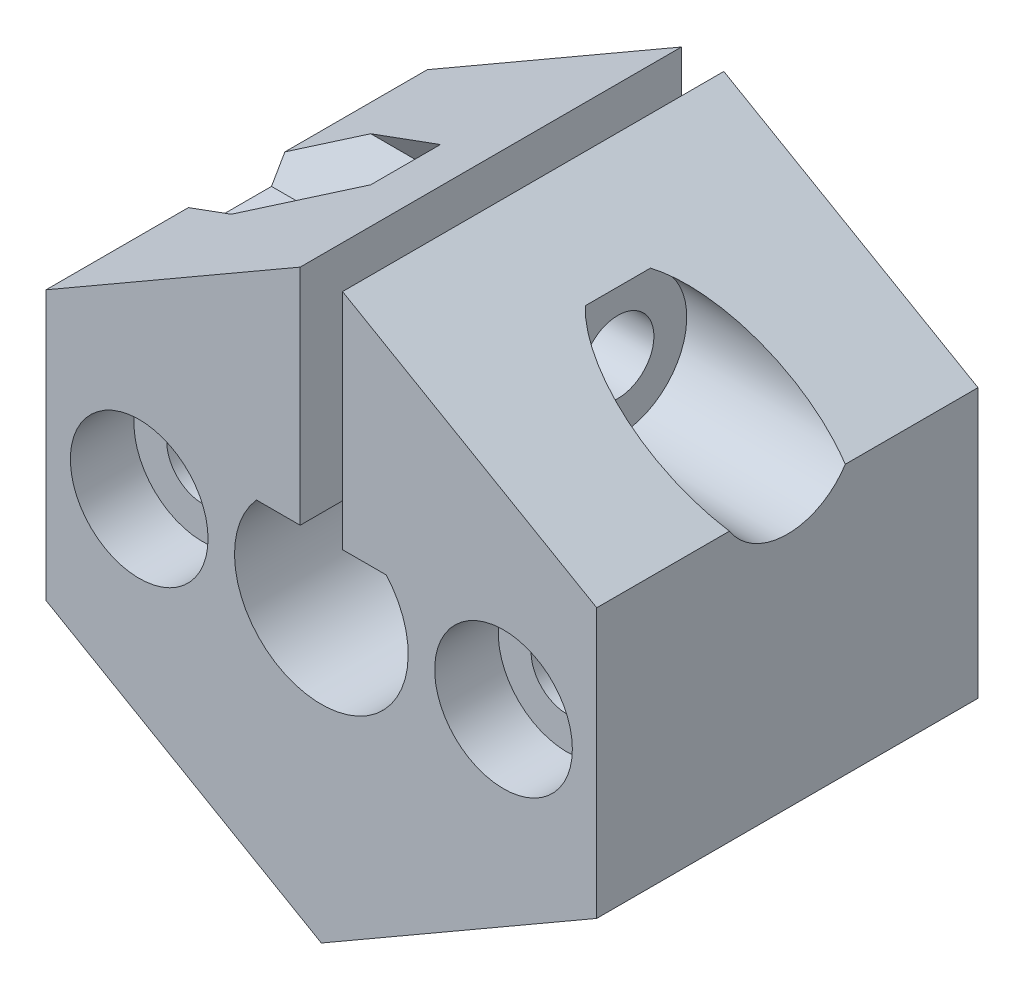
ISO-10303-21;
HEADER;
FILE_DESCRIPTION(('STEP AP214'),'2;1');
FILE_NAME('part.step','',(''),(''),'','','');
FILE_SCHEMA(('AUTOMOTIVE_DESIGN { 1 0 10303 214 1 1 1 1 }'));
ENDSEC;
DATA;
#1=APPLICATION_CONTEXT('core data for automotive mechanical design processes');
#2=APPLICATION_PROTOCOL_DEFINITION('international standard','automotive_design',2000,#1);
#3=PRODUCT_CONTEXT('',#1,'mechanical');
#4=PRODUCT('Part','Part','',(#3));
#5=PRODUCT_RELATED_PRODUCT_CATEGORY('part','',(#4));
#6=PRODUCT_DEFINITION_FORMATION('','',#4);
#7=PRODUCT_DEFINITION_CONTEXT('part definition',#1,'design');
#8=PRODUCT_DEFINITION('design','',#6,#7);
#9=PRODUCT_DEFINITION_SHAPE('','',#8);
#10=(LENGTH_UNIT() NAMED_UNIT(*) SI_UNIT(.MILLI.,.METRE.));
#11=(NAMED_UNIT(*) PLANE_ANGLE_UNIT() SI_UNIT($,.RADIAN.));
#12=(NAMED_UNIT(*) SI_UNIT($,.STERADIAN.) SOLID_ANGLE_UNIT());
#13=UNCERTAINTY_MEASURE_WITH_UNIT(LENGTH_MEASURE(1.E-05),#10,'distance_accuracy_value','');
#14=(GEOMETRIC_REPRESENTATION_CONTEXT(3) GLOBAL_UNCERTAINTY_ASSIGNED_CONTEXT((#13)) GLOBAL_UNIT_ASSIGNED_CONTEXT((#10,
#11,#12)) REPRESENTATION_CONTEXT('',''));
#15=CARTESIAN_POINT('',(0.,0.,0.));
#16=DIRECTION('',(0.,0.,1.));
#17=DIRECTION('',(1.,0.,0.));
#18=AXIS2_PLACEMENT_3D('',#15,#16,#17);
#19=CARTESIAN_POINT('',(-6.,10.3923048454133,18.));
#20=DIRECTION('',(0.5,-0.866025403784439,0.));
#21=DIRECTION('',(0.866025403784439,0.5,0.));
#22=AXIS2_PLACEMENT_3D('',#19,#20,#21);
#23=PLANE('',#22);
#24=DIRECTION('',(-0.832050294337844,-0.480384461415261,0.277350098112615));
#25=VECTOR('',#24,1.);
#26=CARTESIAN_POINT('',(-9.14092167282028,8.57889287210694,5.43631330871886));
#27=LINE('',#26,#25);
#28=CARTESIAN_POINT('',(-9.95929214352109,8.10640646055099,5.70910346561913));
#29=VERTEX_POINT('',#28);
#30=CARTESIAN_POINT('',(-13.,6.35085296108588,6.7226727511121));
#31=VERTEX_POINT('',#30);
#32=EDGE_CURVE('E223',#29,#31,#27,.T.);
#33=ORIENTED_EDGE('',*,*,#32,.F.);
#34=DIRECTION('',(-0.832050294337844,-0.480384461415261,-0.277350098112615));
#35=VECTOR('',#34,1.);
#36=CARTESIAN_POINT('',(-3.46820019541373,11.8540401441254,7.87280078165492));
#37=LINE('',#36,#35);
#38=CARTESIAN_POINT('',(-5.02294734194979,10.956406460551,7.35455173280957));
#39=VERTEX_POINT('',#38);
#40=EDGE_CURVE('E11',#39,#29,#37,.T.);
#41=ORIENTED_EDGE('',*,*,#40,.F.);
#42=DIRECTION('',(0.,0.,-1.));
#43=VECTOR('',#42,1.);
#44=CARTESIAN_POINT('',(-5.02294734194979,10.956406460551,18.));
#45=LINE('',#44,#43);
#46=CARTESIAN_POINT('',(-5.02294734194979,10.956406460551,10.6454482671904));
#47=VERTEX_POINT('',#46);
#48=EDGE_CURVE('E58',#47,#39,#45,.T.);
#49=ORIENTED_EDGE('',*,*,#48,.F.);
#50=DIRECTION('',(0.832050294337844,0.480384461415261,-0.277350098112614));
#51=VECTOR('',#50,1.);
#52=CARTESIAN_POINT('',(-7.62204634925988,9.45581594903002,11.5118146029605));
#53=LINE('',#52,#51);
#54=CARTESIAN_POINT('',(-9.95929214352109,8.10640646055099,12.2908965343809));
#55=VERTEX_POINT('',#54);
#56=EDGE_CURVE('E411',#55,#47,#53,.T.);
#57=ORIENTED_EDGE('',*,*,#56,.F.);
#58=DIRECTION('',(0.832050294337844,0.480384461415261,0.277350098112614));
#59=VECTOR('',#58,1.);
#60=CARTESIAN_POINT('',(-4.98707551897413,10.9771170672023,13.9483020758965));
#61=LINE('',#60,#59);
#62=CARTESIAN_POINT('',(-13.,6.35085296108588,11.2773272488879));
#63=VERTEX_POINT('',#62);
#64=EDGE_CURVE('E215',#63,#55,#61,.T.);
#65=ORIENTED_EDGE('',*,*,#64,.F.);
#66=DIRECTION('',(0.,0.,-1.));
#67=VECTOR('',#66,1.);
#68=CARTESIAN_POINT('',(-13.,6.35085296108588,18.));
#69=LINE('',#68,#67);
#70=CARTESIAN_POINT('',(-13.,6.35085296108588,18.));
#71=VERTEX_POINT('',#70);
#72=EDGE_CURVE('E378',#71,#63,#69,.T.);
#73=ORIENTED_EDGE('',*,*,#72,.F.);
#74=DIRECTION('',(-0.866025403784439,-0.5,0.));
#75=VECTOR('',#74,1.);
#76=CARTESIAN_POINT('',(-6.,10.3923048454133,18.));
#77=LINE('',#76,#75);
#78=CARTESIAN_POINT('',(-0.999999999999999,13.2790561913614,18.));
#79=VERTEX_POINT('',#78);
#80=EDGE_CURVE('E286',#79,#71,#77,.T.);
#81=ORIENTED_EDGE('',*,*,#80,.F.);
#82=DIRECTION('',(0.,0.,-1.));
#83=VECTOR('',#82,1.);
#84=CARTESIAN_POINT('',(-0.999999999999999,13.2790561913614,18.));
#85=LINE('',#84,#83);
#86=CARTESIAN_POINT('',(-0.999999999999999,13.2790561913614,0.));
#87=VERTEX_POINT('',#86);
#88=EDGE_CURVE('E382',#79,#87,#85,.T.);
#89=ORIENTED_EDGE('',*,*,#88,.T.);
#90=DIRECTION('',(-0.866025403784439,-0.5,0.));
#91=VECTOR('',#90,1.);
#92=CARTESIAN_POINT('',(-6.,10.3923048454133,0.));
#93=LINE('',#92,#91);
#94=CARTESIAN_POINT('',(-13.,6.35085296108588,0.));
#95=VERTEX_POINT('',#94);
#96=EDGE_CURVE('E324',#87,#95,#93,.T.);
#97=ORIENTED_EDGE('',*,*,#96,.T.);
#98=EDGE_CURVE('E377',#31,#95,#69,.T.);
#99=ORIENTED_EDGE('',*,*,#98,.F.);
#100=EDGE_LOOP('',(#33,#41,#49,#57,#65,#73,#81,#89,#97,#99));
#101=FACE_BOUND('',#100,.T.);
#102=ADVANCED_FACE('F49',(#101),#23,.F.);
#103=CARTESIAN_POINT('',(-13.,0.,18.));
#104=DIRECTION('',(1.,0.,0.));
#105=DIRECTION('',(0.,0.,-1.));
#106=AXIS2_PLACEMENT_3D('',#103,#104,#105);
#107=PLANE('',#106);
#108=DIRECTION('',(0.,-0.866025403784438,0.5));
#109=VECTOR('',#108,1.);
#110=CARTESIAN_POINT('',(-13.,-3.29551270189223,12.2920045633341));
#111=LINE('',#110,#109);
#112=CARTESIAN_POINT('',(-13.,5.25640646055099,7.35455173280957));
#113=VERTEX_POINT('',#112);
#114=EDGE_CURVE('E408',#31,#113,#111,.T.);
#115=ORIENTED_EDGE('',*,*,#114,.F.);
#116=ORIENTED_EDGE('',*,*,#98,.T.);
#117=DIRECTION('',(0.,-1.,0.));
#118=VECTOR('',#117,1.);
#119=CARTESIAN_POINT('',(-13.,0.,0.));
#120=LINE('',#119,#118);
#121=CARTESIAN_POINT('',(-13.,-6.35085296108589,0.));
#122=VERTEX_POINT('',#121);
#123=EDGE_CURVE('E328',#95,#122,#120,.T.);
#124=ORIENTED_EDGE('',*,*,#123,.T.);
#125=DIRECTION('',(0.,0.,-1.));
#126=VECTOR('',#125,1.);
#127=CARTESIAN_POINT('',(-13.,-6.35085296108589,18.));
#128=LINE('',#127,#126);
#129=CARTESIAN_POINT('',(-13.,-6.35085296108589,18.));
#130=VERTEX_POINT('',#129);
#131=EDGE_CURVE('E373',#130,#122,#128,.T.);
#132=ORIENTED_EDGE('',*,*,#131,.F.);
#133=DIRECTION('',(0.,-1.,0.));
#134=VECTOR('',#133,1.);
#135=CARTESIAN_POINT('',(-13.,0.,18.));
#136=LINE('',#135,#134);
#137=EDGE_CURVE('E289',#71,#130,#136,.T.);
#138=ORIENTED_EDGE('',*,*,#137,.F.);
#139=ORIENTED_EDGE('',*,*,#72,.T.);
#140=DIRECTION('',(0.,0.866025403784439,0.5));
#141=VECTOR('',#140,1.);
#142=CARTESIAN_POINT('',(-13.,4.49871593216772,10.2079954366659));
#143=LINE('',#142,#141);
#144=CARTESIAN_POINT('',(-13.,5.25640646055099,10.6454482671904));
#145=VERTEX_POINT('',#144);
#146=EDGE_CURVE('E405',#145,#63,#143,.T.);
#147=ORIENTED_EDGE('',*,*,#146,.F.);
#148=DIRECTION('',(0.,0.,1.));
#149=VECTOR('',#148,1.);
#150=CARTESIAN_POINT('',(-13.,5.25640646055099,18.));
#151=LINE('',#150,#149);
#152=EDGE_CURVE('E402',#113,#145,#151,.T.);
#153=ORIENTED_EDGE('',*,*,#152,.F.);
#154=EDGE_LOOP('',(#115,#116,#124,#132,#138,#139,#147,#153));
#155=FACE_BOUND('',#154,.T.);
#156=ADVANCED_FACE('F425',(#155),#107,.F.);
#157=CARTESIAN_POINT('',(14.,8.10640646055099,9.));
#158=DIRECTION('',(-1.,0.,0.));
#159=DIRECTION('',(0.,0.,1.));
#160=AXIS2_PLACEMENT_3D('',#157,#158,#159);
#161=CYLINDRICAL_SURFACE('',#160,1.7);
#162=CARTESIAN_POINT('',(1.,8.10640646055099,9.));
#163=DIRECTION('',(1.,0.,0.));
#164=DIRECTION('',(0.,1.,0.));
#165=AXIS2_PLACEMENT_3D('',#162,#163,#164);
#166=CIRCLE('',#165,1.7);
#167=CARTESIAN_POINT('',(1.,9.80640646055099,9.));
#168=VERTEX_POINT('',#167);
#169=EDGE_CURVE('E235',#168,#168,#166,.F.);
#170=ORIENTED_EDGE('',*,*,#169,.T.);
#171=EDGE_LOOP('',(#170));
#172=FACE_BOUND('',#171,.T.);
#173=CARTESIAN_POINT('',(5.00000000000001,8.10640646055099,9.));
#174=DIRECTION('',(1.,0.,0.));
#175=DIRECTION('',(0.,0.,-1.));
#176=AXIS2_PLACEMENT_3D('',#173,#174,#175);
#177=CIRCLE('',#176,1.7);
#178=CARTESIAN_POINT('',(5.00000000000001,8.10640646055099,7.3));
#179=VERTEX_POINT('',#178);
#180=EDGE_CURVE('E229',#179,#179,#177,.T.);
#181=ORIENTED_EDGE('',*,*,#180,.T.);
#182=EDGE_LOOP('',(#181));
#183=FACE_BOUND('',#182,.T.);
#184=ADVANCED_FACE('F526',(#172,#183),#161,.F.);
#185=CARTESIAN_POINT('',(8.6,0.,18.));
#186=DIRECTION('',(0.,0.,-1.));
#187=DIRECTION('',(-1.,0.,0.));
#188=AXIS2_PLACEMENT_3D('',#185,#186,#187);
#189=CYLINDRICAL_SURFACE('',#188,1.7);
#190=CARTESIAN_POINT('',(8.6,0.,0.));
#191=DIRECTION('',(0.,0.,1.));
#192=DIRECTION('',(1.,0.,0.));
#193=AXIS2_PLACEMENT_3D('',#190,#191,#192);
#194=CIRCLE('',#193,1.7);
#195=CARTESIAN_POINT('',(10.3,0.,0.));
#196=VERTEX_POINT('',#195);
#197=EDGE_CURVE('E264',#196,#196,#194,.T.);
#198=ORIENTED_EDGE('',*,*,#197,.F.);
#199=EDGE_LOOP('',(#198));
#200=FACE_BOUND('',#199,.T.);
#201=CARTESIAN_POINT('',(8.6,0.,15.));
#202=DIRECTION('',(0.,0.,1.));
#203=DIRECTION('',(1.,0.,0.));
#204=AXIS2_PLACEMENT_3D('',#201,#202,#203);
#205=CIRCLE('',#204,1.70000000000001);
#206=CARTESIAN_POINT('',(10.3,0.,15.));
#207=VERTEX_POINT('',#206);
#208=EDGE_CURVE('E248',#207,#207,#205,.T.);
#209=ORIENTED_EDGE('',*,*,#208,.T.);
#210=EDGE_LOOP('',(#209));
#211=FACE_BOUND('',#210,.T.);
#212=ADVANCED_FACE('F541',(#200,#211),#189,.F.);
#213=CARTESIAN_POINT('',(-8.6,0.,18.));
#214=DIRECTION('',(0.,0.,-1.));
#215=DIRECTION('',(-1.,0.,0.));
#216=AXIS2_PLACEMENT_3D('',#213,#214,#215);
#217=CYLINDRICAL_SURFACE('',#216,1.7);
#218=CARTESIAN_POINT('',(-8.6,0.,0.));
#219=DIRECTION('',(0.,0.,1.));
#220=DIRECTION('',(1.,0.,0.));
#221=AXIS2_PLACEMENT_3D('',#218,#219,#220);
#222=CIRCLE('',#221,1.7);
#223=CARTESIAN_POINT('',(-6.9,0.,0.));
#224=VERTEX_POINT('',#223);
#225=EDGE_CURVE('E265',#224,#224,#222,.T.);
#226=ORIENTED_EDGE('',*,*,#225,.F.);
#227=EDGE_LOOP('',(#226));
#228=FACE_BOUND('',#227,.T.);
#229=CARTESIAN_POINT('',(-8.6,0.,15.));
#230=DIRECTION('',(0.,0.,1.));
#231=DIRECTION('',(1.,0.,0.));
#232=AXIS2_PLACEMENT_3D('',#229,#230,#231);
#233=CIRCLE('',#232,1.7);
#234=CARTESIAN_POINT('',(-6.9,0.,15.));
#235=VERTEX_POINT('',#234);
#236=EDGE_CURVE('E260',#235,#235,#233,.T.);
#237=ORIENTED_EDGE('',*,*,#236,.T.);
#238=EDGE_LOOP('',(#237));
#239=FACE_BOUND('',#238,.T.);
#240=ADVANCED_FACE('F537',(#228,#239),#217,.F.);
#241=CARTESIAN_POINT('',(0.,0.,18.));
#242=DIRECTION('',(0.,0.,-1.));
#243=DIRECTION('',(-1.,0.,0.));
#244=AXIS2_PLACEMENT_3D('',#241,#242,#243);
#245=CYLINDRICAL_SURFACE('',#244,4.1);
#246=CARTESIAN_POINT('',(0.,0.,0.));
#247=DIRECTION('',(0.,0.,1.));
#248=DIRECTION('',(1.,0.,0.));
#249=AXIS2_PLACEMENT_3D('',#246,#247,#248);
#250=CIRCLE('',#249,4.1);
#251=CARTESIAN_POINT('',(-3.06340496519782,2.72498624202056,0.));
#252=VERTEX_POINT('',#251);
#253=CARTESIAN_POINT('',(3.06340496519781,2.72498624202058,0.));
#254=VERTEX_POINT('',#253);
#255=EDGE_CURVE('E269',#252,#254,#250,.T.);
#256=ORIENTED_EDGE('',*,*,#255,.F.);
#257=DIRECTION('',(0.,0.,-1.));
#258=VECTOR('',#257,1.);
#259=CARTESIAN_POINT('',(-3.06340496519782,2.72498624202056,18.));
#260=LINE('',#259,#258);
#261=CARTESIAN_POINT('',(-3.06340496519782,2.72498624202056,18.));
#262=VERTEX_POINT('',#261);
#263=EDGE_CURVE('E388',#262,#252,#260,.T.);
#264=ORIENTED_EDGE('',*,*,#263,.F.);
#265=CARTESIAN_POINT('',(0.,0.,18.));
#266=DIRECTION('',(0.,0.,1.));
#267=DIRECTION('',(1.,0.,0.));
#268=AXIS2_PLACEMENT_3D('',#265,#266,#267);
#269=CIRCLE('',#268,4.1);
#270=CARTESIAN_POINT('',(3.06340496519781,2.72498624202058,18.));
#271=VERTEX_POINT('',#270);
#272=EDGE_CURVE('E273',#262,#271,#269,.T.);
#273=ORIENTED_EDGE('',*,*,#272,.T.);
#274=DIRECTION('',(0.,0.,-1.));
#275=VECTOR('',#274,1.);
#276=CARTESIAN_POINT('',(3.06340496519781,2.72498624202058,18.));
#277=LINE('',#276,#275);
#278=EDGE_CURVE('E312',#271,#254,#277,.T.);
#279=ORIENTED_EDGE('',*,*,#278,.T.);
#280=EDGE_LOOP('',(#256,#264,#273,#279));
#281=FACE_BOUND('',#280,.T.);
#282=ADVANCED_FACE('F51',(#281),#245,.F.);
#283=CARTESIAN_POINT('',(0.,2.72498624202057,18.));
#284=DIRECTION('',(0.,-1.,0.));
#285=DIRECTION('',(1.,0.,0.));
#286=AXIS2_PLACEMENT_3D('',#283,#284,#285);
#287=PLANE('',#286);
#288=DIRECTION('',(-1.,0.,0.));
#289=VECTOR('',#288,1.);
#290=CARTESIAN_POINT('',(0.,2.72498624202057,0.));
#291=LINE('',#290,#289);
#292=CARTESIAN_POINT('',(-1.,2.72498624202056,0.));
#293=VERTEX_POINT('',#292);
#294=EDGE_CURVE('E316',#293,#252,#291,.T.);
#295=ORIENTED_EDGE('',*,*,#294,.F.);
#296=DIRECTION('',(0.,0.,-1.));
#297=VECTOR('',#296,1.);
#298=CARTESIAN_POINT('',(-1.,2.72498624202056,18.));
#299=LINE('',#298,#297);
#300=CARTESIAN_POINT('',(-1.,2.72498624202056,18.));
#301=VERTEX_POINT('',#300);
#302=EDGE_CURVE('E385',#301,#293,#299,.T.);
#303=ORIENTED_EDGE('',*,*,#302,.F.);
#304=DIRECTION('',(-1.,0.,0.));
#305=VECTOR('',#304,1.);
#306=CARTESIAN_POINT('',(0.,2.72498624202057,18.));
#307=LINE('',#306,#305);
#308=EDGE_CURVE('E277',#301,#262,#307,.T.);
#309=ORIENTED_EDGE('',*,*,#308,.T.);
#310=ORIENTED_EDGE('',*,*,#263,.T.);
#311=EDGE_LOOP('',(#295,#303,#309,#310));
#312=FACE_BOUND('',#311,.T.);
#313=ADVANCED_FACE('F479',(#312),#287,.T.);
#314=CARTESIAN_POINT('',(-1.,0.,18.));
#315=DIRECTION('',(1.,0.,0.));
#316=DIRECTION('',(0.,0.,-1.));
#317=AXIS2_PLACEMENT_3D('',#314,#315,#316);
#318=PLANE('',#317);
#319=CARTESIAN_POINT('',(-0.999999999999999,8.10640646055099,9.));
#320=DIRECTION('',(1.,0.,0.));
#321=DIRECTION('',(0.,0.,-1.));
#322=AXIS2_PLACEMENT_3D('',#319,#320,#321);
#323=CIRCLE('',#322,1.7);
#324=CARTESIAN_POINT('',(-0.999999999999999,8.10640646055099,7.3));
#325=VERTEX_POINT('',#324);
#326=EDGE_CURVE('E236',#325,#325,#323,.F.);
#327=ORIENTED_EDGE('',*,*,#326,.T.);
#328=EDGE_LOOP('',(#327));
#329=FACE_BOUND('',#328,.T.);
#330=DIRECTION('',(0.,-1.,0.));
#331=VECTOR('',#330,1.);
#332=CARTESIAN_POINT('',(-1.,0.,0.));
#333=LINE('',#332,#331);
#334=EDGE_CURVE('E320',#87,#293,#333,.T.);
#335=ORIENTED_EDGE('',*,*,#334,.F.);
#336=ORIENTED_EDGE('',*,*,#88,.F.);
#337=DIRECTION('',(0.,-1.,0.));
#338=VECTOR('',#337,1.);
#339=CARTESIAN_POINT('',(-1.,0.,18.));
#340=LINE('',#339,#338);
#341=EDGE_CURVE('E282',#79,#301,#340,.T.);
#342=ORIENTED_EDGE('',*,*,#341,.T.);
#343=ORIENTED_EDGE('',*,*,#302,.T.);
#344=EDGE_LOOP('',(#335,#336,#342,#343));
#345=FACE_BOUND('',#344,.T.);
#346=ADVANCED_FACE('F476',(#329,#345),#318,.T.);
#347=CARTESIAN_POINT('',(-6.,-10.3923048454133,18.));
#348=DIRECTION('',(0.5,0.866025403784439,0.));
#349=DIRECTION('',(-0.866025403784439,0.5,0.));
#350=AXIS2_PLACEMENT_3D('',#347,#348,#349);
#351=PLANE('',#350);
#352=DIRECTION('',(0.866025403784439,-0.5,0.));
#353=VECTOR('',#352,1.);
#354=CARTESIAN_POINT('',(-6.,-10.3923048454133,0.));
#355=LINE('',#354,#353);
#356=CARTESIAN_POINT('',(0.,-13.856406460551,0.));
#357=VERTEX_POINT('',#356);
#358=EDGE_CURVE('E331',#122,#357,#355,.T.);
#359=ORIENTED_EDGE('',*,*,#358,.T.);
#360=DIRECTION('',(0.,0.,-1.));
#361=VECTOR('',#360,1.);
#362=CARTESIAN_POINT('',(0.,-13.856406460551,18.));
#363=LINE('',#362,#361);
#364=CARTESIAN_POINT('',(0.,-13.856406460551,18.));
#365=VERTEX_POINT('',#364);
#366=EDGE_CURVE('E369',#365,#357,#363,.T.);
#367=ORIENTED_EDGE('',*,*,#366,.F.);
#368=DIRECTION('',(0.866025403784439,-0.5,0.));
#369=VECTOR('',#368,1.);
#370=CARTESIAN_POINT('',(-6.,-10.3923048454133,18.));
#371=LINE('',#370,#369);
#372=EDGE_CURVE('E292',#130,#365,#371,.T.);
#373=ORIENTED_EDGE('',*,*,#372,.F.);
#374=ORIENTED_EDGE('',*,*,#131,.T.);
#375=EDGE_LOOP('',(#359,#367,#373,#374));
#376=FACE_BOUND('',#375,.T.);
#377=ADVANCED_FACE('F506',(#376),#351,.F.);
#378=CARTESIAN_POINT('',(6.00000000000001,-10.3923048454133,18.));
#379=DIRECTION('',(-0.500000000000001,0.866025403784438,0.));
#380=DIRECTION('',(-0.866025403784438,-0.500000000000001,0.));
#381=AXIS2_PLACEMENT_3D('',#378,#379,#380);
#382=PLANE('',#381);
#383=DIRECTION('',(0.866025403784438,0.500000000000001,0.));
#384=VECTOR('',#383,1.);
#385=CARTESIAN_POINT('',(6.00000000000001,-10.3923048454133,0.));
#386=LINE('',#385,#384);
#387=CARTESIAN_POINT('',(13.,-6.35085296108588,0.));
#388=VERTEX_POINT('',#387);
#389=EDGE_CURVE('E334',#357,#388,#386,.T.);
#390=ORIENTED_EDGE('',*,*,#389,.T.);
#391=DIRECTION('',(0.,0.,-1.));
#392=VECTOR('',#391,1.);
#393=CARTESIAN_POINT('',(13.,-6.35085296108588,18.));
#394=LINE('',#393,#392);
#395=CARTESIAN_POINT('',(13.,-6.35085296108588,18.));
#396=VERTEX_POINT('',#395);
#397=EDGE_CURVE('E366',#396,#388,#394,.T.);
#398=ORIENTED_EDGE('',*,*,#397,.F.);
#399=DIRECTION('',(0.866025403784438,0.500000000000001,0.));
#400=VECTOR('',#399,1.);
#401=CARTESIAN_POINT('',(6.00000000000001,-10.3923048454133,18.));
#402=LINE('',#401,#400);
#403=EDGE_CURVE('E295',#365,#396,#402,.T.);
#404=ORIENTED_EDGE('',*,*,#403,.F.);
#405=ORIENTED_EDGE('',*,*,#366,.T.);
#406=EDGE_LOOP('',(#390,#398,#404,#405));
#407=FACE_BOUND('',#406,.T.);
#408=ADVANCED_FACE('F504',(#407),#382,.F.);
#409=CARTESIAN_POINT('',(13.,0.,18.));
#410=DIRECTION('',(1.,0.,0.));
#411=DIRECTION('',(0.,1.,0.));
#412=AXIS2_PLACEMENT_3D('',#409,#410,#411);
#413=PLANE('',#412);
#414=CARTESIAN_POINT('',(13.,8.10640646055099,9.));
#415=DIRECTION('',(1.,0.,0.));
#416=DIRECTION('',(0.,0.,-1.));
#417=AXIS2_PLACEMENT_3D('',#414,#415,#416);
#418=CIRCLE('',#417,3.25);
#419=CARTESIAN_POINT('',(13.,6.35085296108589,11.7350561073799));
#420=VERTEX_POINT('',#419);
#421=CARTESIAN_POINT('',(13.,6.35085296108589,6.26494389262015));
#422=VERTEX_POINT('',#421);
#423=EDGE_CURVE('E226',#420,#422,#418,.T.);
#424=ORIENTED_EDGE('',*,*,#423,.F.);
#425=DIRECTION('',(0.,0.,-1.));
#426=VECTOR('',#425,1.);
#427=CARTESIAN_POINT('',(13.,6.35085296108589,18.));
#428=LINE('',#427,#426);
#429=CARTESIAN_POINT('',(13.,6.35085296108589,18.));
#430=VERTEX_POINT('',#429);
#431=EDGE_CURVE('E362',#430,#420,#428,.T.);
#432=ORIENTED_EDGE('',*,*,#431,.F.);
#433=DIRECTION('',(0.,-1.,0.));
#434=VECTOR('',#433,1.);
#435=CARTESIAN_POINT('',(13.,0.,18.));
#436=LINE('',#435,#434);
#437=EDGE_CURVE('E298',#430,#396,#436,.T.);
#438=ORIENTED_EDGE('',*,*,#437,.T.);
#439=ORIENTED_EDGE('',*,*,#397,.T.);
#440=DIRECTION('',(0.,-1.,0.));
#441=VECTOR('',#440,1.);
#442=CARTESIAN_POINT('',(13.,0.,0.));
#443=LINE('',#442,#441);
#444=CARTESIAN_POINT('',(13.,6.35085296108589,0.));
#445=VERTEX_POINT('',#444);
#446=EDGE_CURVE('E338',#445,#388,#443,.T.);
#447=ORIENTED_EDGE('',*,*,#446,.F.);
#448=EDGE_CURVE('E361',#422,#445,#428,.T.);
#449=ORIENTED_EDGE('',*,*,#448,.F.);
#450=EDGE_LOOP('',(#424,#432,#438,#439,#447,#449));
#451=FACE_BOUND('',#450,.T.);
#452=ADVANCED_FACE('F499',(#451),#413,.T.);
#453=CARTESIAN_POINT('',(5.99999999999999,10.3923048454133,18.));
#454=DIRECTION('',(-0.499999999999999,-0.866025403784439,0.));
#455=DIRECTION('',(0.866025403784439,-0.5,0.));
#456=AXIS2_PLACEMENT_3D('',#453,#454,#455);
#457=PLANE('',#456);
#458=ORIENTED_EDGE('',*,*,#431,.T.);
#459=CARTESIAN_POINT('',(9.95929214352109,8.10640646055099,9.));
#460=DIRECTION('',(-0.499999999999999,-0.866025403784439,0.));
#461=DIRECTION('',(0.866025403784439,-0.5,0.));
#462=AXIS2_PLACEMENT_3D('',#459,#460,#461);
#463=ELLIPSE('',#462,6.50000000000001,3.25);
#464=CARTESIAN_POINT('',(5.00000000000001,10.9696551146029,10.5376303668535));
#465=VERTEX_POINT('',#464);
#466=EDGE_CURVE('E400',#420,#465,#463,.T.);
#467=ORIENTED_EDGE('',*,*,#466,.T.);
#468=DIRECTION('',(0.,0.,1.));
#469=VECTOR('',#468,1.);
#470=CARTESIAN_POINT('',(5.00000000000001,10.9696551146029,18.));
#471=LINE('',#470,#469);
#472=CARTESIAN_POINT('',(5.00000000000001,10.9696551146029,7.4623696331465));
#473=VERTEX_POINT('',#472);
#474=EDGE_CURVE('E232',#473,#465,#471,.T.);
#475=ORIENTED_EDGE('',*,*,#474,.F.);
#476=EDGE_CURVE('E391',#473,#422,#463,.T.);
#477=ORIENTED_EDGE('',*,*,#476,.T.);
#478=ORIENTED_EDGE('',*,*,#448,.T.);
#479=DIRECTION('',(-0.866025403784439,0.5,0.));
#480=VECTOR('',#479,1.);
#481=CARTESIAN_POINT('',(5.99999999999999,10.3923048454133,0.));
#482=LINE('',#481,#480);
#483=CARTESIAN_POINT('',(1.,13.2790561913614,0.));
#484=VERTEX_POINT('',#483);
#485=EDGE_CURVE('E342',#445,#484,#482,.T.);
#486=ORIENTED_EDGE('',*,*,#485,.T.);
#487=DIRECTION('',(0.,0.,-1.));
#488=VECTOR('',#487,1.);
#489=CARTESIAN_POINT('',(1.,13.2790561913614,18.));
#490=LINE('',#489,#488);
#491=CARTESIAN_POINT('',(1.,13.2790561913614,18.));
#492=VERTEX_POINT('',#491);
#493=EDGE_CURVE('E357',#492,#484,#490,.T.);
#494=ORIENTED_EDGE('',*,*,#493,.F.);
#495=DIRECTION('',(-0.866025403784439,0.5,0.));
#496=VECTOR('',#495,1.);
#497=CARTESIAN_POINT('',(5.99999999999999,10.3923048454133,18.));
#498=LINE('',#497,#496);
#499=EDGE_CURVE('E302',#430,#492,#498,.T.);
#500=ORIENTED_EDGE('',*,*,#499,.F.);
#501=EDGE_LOOP('',(#458,#467,#475,#477,#478,#486,#494,#500));
#502=FACE_BOUND('',#501,.T.);
#503=ADVANCED_FACE('F508',(#502),#457,.F.);
#504=CARTESIAN_POINT('',(1.,0.,18.));
#505=DIRECTION('',(1.,0.,0.));
#506=DIRECTION('',(0.,1.,0.));
#507=AXIS2_PLACEMENT_3D('',#504,#505,#506);
#508=PLANE('',#507);
#509=ORIENTED_EDGE('',*,*,#169,.F.);
#510=EDGE_LOOP('',(#509));
#511=FACE_BOUND('',#510,.T.);
#512=DIRECTION('',(0.,-1.,0.));
#513=VECTOR('',#512,1.);
#514=CARTESIAN_POINT('',(1.,0.,0.));
#515=LINE('',#514,#513);
#516=CARTESIAN_POINT('',(1.,2.72498624202057,0.));
#517=VERTEX_POINT('',#516);
#518=EDGE_CURVE('E345',#484,#517,#515,.T.);
#519=ORIENTED_EDGE('',*,*,#518,.T.);
#520=DIRECTION('',(0.,0.,-1.));
#521=VECTOR('',#520,1.);
#522=CARTESIAN_POINT('',(1.,2.72498624202057,18.));
#523=LINE('',#522,#521);
#524=CARTESIAN_POINT('',(1.,2.72498624202057,18.));
#525=VERTEX_POINT('',#524);
#526=EDGE_CURVE('E354',#525,#517,#523,.T.);
#527=ORIENTED_EDGE('',*,*,#526,.F.);
#528=DIRECTION('',(0.,-1.,0.));
#529=VECTOR('',#528,1.);
#530=CARTESIAN_POINT('',(1.,0.,18.));
#531=LINE('',#530,#529);
#532=EDGE_CURVE('E305',#492,#525,#531,.T.);
#533=ORIENTED_EDGE('',*,*,#532,.F.);
#534=ORIENTED_EDGE('',*,*,#493,.T.);
#535=EDGE_LOOP('',(#519,#527,#533,#534));
#536=FACE_BOUND('',#535,.T.);
#537=ADVANCED_FACE('F490',(#511,#536),#508,.F.);
#538=CARTESIAN_POINT('',(0.,2.72498624202057,18.));
#539=DIRECTION('',(0.,-1.,0.));
#540=DIRECTION('',(1.,0.,0.));
#541=AXIS2_PLACEMENT_3D('',#538,#539,#540);
#542=PLANE('',#541);
#543=DIRECTION('',(-1.,0.,0.));
#544=VECTOR('',#543,1.);
#545=CARTESIAN_POINT('',(0.,2.72498624202057,0.));
#546=LINE('',#545,#544);
#547=EDGE_CURVE('E278',#254,#517,#546,.T.);
#548=ORIENTED_EDGE('',*,*,#547,.F.);
#549=ORIENTED_EDGE('',*,*,#278,.F.);
#550=DIRECTION('',(-1.,0.,0.));
#551=VECTOR('',#550,1.);
#552=CARTESIAN_POINT('',(0.,2.72498624202057,18.));
#553=LINE('',#552,#551);
#554=EDGE_CURVE('E308',#271,#525,#553,.T.);
#555=ORIENTED_EDGE('',*,*,#554,.T.);
#556=ORIENTED_EDGE('',*,*,#526,.T.);
#557=EDGE_LOOP('',(#548,#549,#555,#556));
#558=FACE_BOUND('',#557,.T.);
#559=ADVANCED_FACE('F485',(#558),#542,.T.);
#560=CARTESIAN_POINT('',(0.,0.,18.));
#561=DIRECTION('',(0.,0.,1.));
#562=DIRECTION('',(1.,0.,0.));
#563=AXIS2_PLACEMENT_3D('',#560,#561,#562);
#564=PLANE('',#563);
#565=CARTESIAN_POINT('',(8.6,0.,18.));
#566=DIRECTION('',(0.,0.,1.));
#567=DIRECTION('',(1.,0.,0.));
#568=AXIS2_PLACEMENT_3D('',#565,#566,#567);
#569=CIRCLE('',#568,3.25);
#570=CARTESIAN_POINT('',(11.85,0.,18.));
#571=VERTEX_POINT('',#570);
#572=EDGE_CURVE('E240',#571,#571,#569,.T.);
#573=ORIENTED_EDGE('',*,*,#572,.F.);
#574=EDGE_LOOP('',(#573));
#575=FACE_BOUND('',#574,.T.);
#576=CARTESIAN_POINT('',(-8.6,0.,18.));
#577=DIRECTION('',(0.,0.,1.));
#578=DIRECTION('',(1.,0.,0.));
#579=AXIS2_PLACEMENT_3D('',#576,#577,#578);
#580=CIRCLE('',#579,3.25);
#581=CARTESIAN_POINT('',(-5.35,0.,18.));
#582=VERTEX_POINT('',#581);
#583=EDGE_CURVE('E252',#582,#582,#580,.T.);
#584=ORIENTED_EDGE('',*,*,#583,.F.);
#585=EDGE_LOOP('',(#584));
#586=FACE_BOUND('',#585,.T.);
#587=ORIENTED_EDGE('',*,*,#272,.F.);
#588=ORIENTED_EDGE('',*,*,#308,.F.);
#589=ORIENTED_EDGE('',*,*,#341,.F.);
#590=ORIENTED_EDGE('',*,*,#80,.T.);
#591=ORIENTED_EDGE('',*,*,#137,.T.);
#592=ORIENTED_EDGE('',*,*,#372,.T.);
#593=ORIENTED_EDGE('',*,*,#403,.T.);
#594=ORIENTED_EDGE('',*,*,#437,.F.);
#595=ORIENTED_EDGE('',*,*,#499,.T.);
#596=ORIENTED_EDGE('',*,*,#532,.T.);
#597=ORIENTED_EDGE('',*,*,#554,.F.);
#598=EDGE_LOOP('',(#587,#588,#589,#590,#591,#592,#593,#594,#595,#596,#597));
#599=FACE_BOUND('',#598,.T.);
#600=ADVANCED_FACE('F465',(#575,#586,#599),#564,.T.);
#601=CARTESIAN_POINT('',(0.,0.,0.));
#602=DIRECTION('',(0.,0.,1.));
#603=DIRECTION('',(1.,0.,0.));
#604=AXIS2_PLACEMENT_3D('',#601,#602,#603);
#605=PLANE('',#604);
#606=ORIENTED_EDGE('',*,*,#225,.T.);
#607=EDGE_LOOP('',(#606));
#608=FACE_BOUND('',#607,.T.);
#609=ORIENTED_EDGE('',*,*,#197,.T.);
#610=EDGE_LOOP('',(#609));
#611=FACE_BOUND('',#610,.T.);
#612=ORIENTED_EDGE('',*,*,#255,.T.);
#613=ORIENTED_EDGE('',*,*,#547,.T.);
#614=ORIENTED_EDGE('',*,*,#518,.F.);
#615=ORIENTED_EDGE('',*,*,#485,.F.);
#616=ORIENTED_EDGE('',*,*,#446,.T.);
#617=ORIENTED_EDGE('',*,*,#389,.F.);
#618=ORIENTED_EDGE('',*,*,#358,.F.);
#619=ORIENTED_EDGE('',*,*,#123,.F.);
#620=ORIENTED_EDGE('',*,*,#96,.F.);
#621=ORIENTED_EDGE('',*,*,#334,.T.);
#622=ORIENTED_EDGE('',*,*,#294,.T.);
#623=EDGE_LOOP('',(#612,#613,#614,#615,#616,#617,#618,#619,#620,#621,#622));
#624=FACE_BOUND('',#623,.T.);
#625=ADVANCED_FACE('F474',(#608,#611,#624),#605,.F.);
#626=CARTESIAN_POINT('',(-6.9,0.,15.));
#627=DIRECTION('',(0.,0.,-1.));
#628=DIRECTION('',(-1.,0.,0.));
#629=AXIS2_PLACEMENT_3D('',#626,#627,#628);
#630=PLANE('',#629);
#631=ORIENTED_EDGE('',*,*,#236,.F.);
#632=EDGE_LOOP('',(#631));
#633=FACE_BOUND('',#632,.T.);
#634=CARTESIAN_POINT('',(-8.6,0.,15.));
#635=DIRECTION('',(0.,0.,1.));
#636=DIRECTION('',(1.,0.,0.));
#637=AXIS2_PLACEMENT_3D('',#634,#635,#636);
#638=CIRCLE('',#637,3.25);
#639=CARTESIAN_POINT('',(-5.35,0.,15.));
#640=VERTEX_POINT('',#639);
#641=EDGE_CURVE('E256',#640,#640,#638,.T.);
#642=ORIENTED_EDGE('',*,*,#641,.T.);
#643=EDGE_LOOP('',(#642));
#644=FACE_BOUND('',#643,.T.);
#645=ADVANCED_FACE('F554',(#633,#644),#630,.F.);
#646=CARTESIAN_POINT('',(-8.6,0.,18.));
#647=DIRECTION('',(0.,0.,1.));
#648=DIRECTION('',(1.,0.,0.));
#649=AXIS2_PLACEMENT_3D('',#646,#647,#648);
#650=CYLINDRICAL_SURFACE('',#649,3.25);
#651=ORIENTED_EDGE('',*,*,#641,.F.);
#652=EDGE_LOOP('',(#651));
#653=FACE_BOUND('',#652,.T.);
#654=ORIENTED_EDGE('',*,*,#583,.T.);
#655=EDGE_LOOP('',(#654));
#656=FACE_BOUND('',#655,.T.);
#657=ADVANCED_FACE('F591',(#653,#656),#650,.F.);
#658=CARTESIAN_POINT('',(10.3,0.,15.));
#659=DIRECTION('',(0.,0.,-1.));
#660=DIRECTION('',(-1.,0.,0.));
#661=AXIS2_PLACEMENT_3D('',#658,#659,#660);
#662=PLANE('',#661);
#663=ORIENTED_EDGE('',*,*,#208,.F.);
#664=EDGE_LOOP('',(#663));
#665=FACE_BOUND('',#664,.T.);
#666=CARTESIAN_POINT('',(8.6,0.,15.));
#667=DIRECTION('',(0.,0.,1.));
#668=DIRECTION('',(1.,0.,0.));
#669=AXIS2_PLACEMENT_3D('',#666,#667,#668);
#670=CIRCLE('',#669,3.25);
#671=CARTESIAN_POINT('',(11.85,0.,15.));
#672=VERTEX_POINT('',#671);
#673=EDGE_CURVE('E244',#672,#672,#670,.T.);
#674=ORIENTED_EDGE('',*,*,#673,.T.);
#675=EDGE_LOOP('',(#674));
#676=FACE_BOUND('',#675,.T.);
#677=ADVANCED_FACE('F600',(#665,#676),#662,.F.);
#678=CARTESIAN_POINT('',(8.6,0.,18.));
#679=DIRECTION('',(0.,0.,1.));
#680=DIRECTION('',(1.,0.,0.));
#681=AXIS2_PLACEMENT_3D('',#678,#679,#680);
#682=CYLINDRICAL_SURFACE('',#681,3.25);
#683=ORIENTED_EDGE('',*,*,#673,.F.);
#684=EDGE_LOOP('',(#683));
#685=FACE_BOUND('',#684,.T.);
#686=ORIENTED_EDGE('',*,*,#572,.T.);
#687=EDGE_LOOP('',(#686));
#688=FACE_BOUND('',#687,.T.);
#689=ADVANCED_FACE('F614',(#685,#688),#682,.F.);
#690=CARTESIAN_POINT('',(-4.00000000000001,8.10640646055099,9.));
#691=DIRECTION('',(1.,0.,0.));
#692=DIRECTION('',(0.,0.,-1.));
#693=AXIS2_PLACEMENT_3D('',#690,#691,#692);
#694=CIRCLE('',#693,1.7);
#695=CARTESIAN_POINT('',(-4.00000000000001,8.10640646055099,7.3));
#696=VERTEX_POINT('',#695);
#697=EDGE_CURVE('E209',#696,#696,#694,.T.);
#698=ORIENTED_EDGE('',*,*,#697,.F.);
#699=EDGE_LOOP('',(#698));
#700=FACE_BOUND('',#699,.T.);
#701=ORIENTED_EDGE('',*,*,#326,.F.);
#702=EDGE_LOOP('',(#701));
#703=FACE_BOUND('',#702,.T.);
#704=ADVANCED_FACE('F624',(#700,#703),#161,.F.);
#705=CARTESIAN_POINT('',(5.00000000000001,8.10640646055099,9.));
#706=DIRECTION('',(1.,0.,0.));
#707=DIRECTION('',(0.,0.,-1.));
#708=AXIS2_PLACEMENT_3D('',#705,#706,#707);
#709=CYLINDRICAL_SURFACE('',#708,3.25);
#710=ORIENTED_EDGE('',*,*,#423,.T.);
#711=ORIENTED_EDGE('',*,*,#476,.F.);
#712=CARTESIAN_POINT('',(5.00000000000001,8.10640646055099,9.));
#713=DIRECTION('',(1.,0.,0.));
#714=DIRECTION('',(0.,0.,-1.));
#715=AXIS2_PLACEMENT_3D('',#712,#713,#714);
#716=CIRCLE('',#715,3.25);
#717=EDGE_CURVE('E72',#465,#473,#716,.T.);
#718=ORIENTED_EDGE('',*,*,#717,.F.);
#719=ORIENTED_EDGE('',*,*,#466,.F.);
#720=EDGE_LOOP('',(#710,#711,#718,#719));
#721=FACE_BOUND('',#720,.T.);
#722=ADVANCED_FACE('F634',(#721),#709,.F.);
#723=CARTESIAN_POINT('',(5.00000000000001,8.10640646055099,9.));
#724=DIRECTION('',(1.,0.,0.));
#725=DIRECTION('',(0.,0.,-1.));
#726=AXIS2_PLACEMENT_3D('',#723,#724,#725);
#727=PLANE('',#726);
#728=ORIENTED_EDGE('',*,*,#180,.F.);
#729=EDGE_LOOP('',(#728));
#730=FACE_BOUND('',#729,.T.);
#731=ORIENTED_EDGE('',*,*,#474,.T.);
#732=ORIENTED_EDGE('',*,*,#717,.T.);
#733=EDGE_LOOP('',(#731,#732));
#734=FACE_BOUND('',#733,.T.);
#735=ADVANCED_FACE('F651',(#730,#734),#727,.T.);
#736=CARTESIAN_POINT('',(-4.00000000000001,8.10640646055099,5.70910346561913));
#737=DIRECTION('',(0.,-0.5,0.866025403784439));
#738=DIRECTION('',(0.,-0.866025403784439,-0.5));
#739=AXIS2_PLACEMENT_3D('',#736,#737,#738);
#740=PLANE('',#739);
#741=ORIENTED_EDGE('',*,*,#40,.T.);
#742=DIRECTION('',(-1.,0.,0.));
#743=VECTOR('',#742,1.);
#744=CARTESIAN_POINT('',(-4.00000000000001,8.10640646055099,5.70910346561913));
#745=LINE('',#744,#743);
#746=CARTESIAN_POINT('',(-4.00000000000001,8.10640646055099,5.70910346561913));
#747=VERTEX_POINT('',#746);
#748=EDGE_CURVE('E202',#747,#29,#745,.T.);
#749=ORIENTED_EDGE('',*,*,#748,.F.);
#750=DIRECTION('',(0.,0.866025403784439,0.5));
#751=VECTOR('',#750,1.);
#752=CARTESIAN_POINT('',(-4.00000000000001,8.10640646055099,5.70910346561913));
#753=LINE('',#752,#751);
#754=CARTESIAN_POINT('',(-4.00000000000001,10.956406460551,7.35455173280957));
#755=VERTEX_POINT('',#754);
#756=EDGE_CURVE('E186',#747,#755,#753,.T.);
#757=ORIENTED_EDGE('',*,*,#756,.T.);
#758=DIRECTION('',(-1.,0.,0.));
#759=VECTOR('',#758,1.);
#760=CARTESIAN_POINT('',(-4.00000000000001,10.956406460551,7.35455173280957));
#761=LINE('',#760,#759);
#762=EDGE_CURVE('E210',#755,#39,#761,.T.);
#763=ORIENTED_EDGE('',*,*,#762,.T.);
#764=EDGE_LOOP('',(#741,#749,#757,#763));
#765=FACE_BOUND('',#764,.T.);
#766=ADVANCED_FACE('F206',(#765),#740,.T.);
#767=CARTESIAN_POINT('',(-4.00000000000001,10.956406460551,7.35455173280957));
#768=DIRECTION('',(0.,-1.,0.));
#769=DIRECTION('',(0.,0.,-1.));
#770=AXIS2_PLACEMENT_3D('',#767,#768,#769);
#771=PLANE('',#770);
#772=ORIENTED_EDGE('',*,*,#48,.T.);
#773=ORIENTED_EDGE('',*,*,#762,.F.);
#774=DIRECTION('',(0.,0.,1.));
#775=VECTOR('',#774,1.);
#776=CARTESIAN_POINT('',(-4.00000000000001,10.956406460551,7.35455173280957));
#777=LINE('',#776,#775);
#778=CARTESIAN_POINT('',(-4.00000000000001,10.956406460551,10.6454482671904));
#779=VERTEX_POINT('',#778);
#780=EDGE_CURVE('E192',#755,#779,#777,.T.);
#781=ORIENTED_EDGE('',*,*,#780,.T.);
#782=DIRECTION('',(-1.,0.,0.));
#783=VECTOR('',#782,1.);
#784=CARTESIAN_POINT('',(-4.00000000000001,10.956406460551,10.6454482671904));
#785=LINE('',#784,#783);
#786=EDGE_CURVE('E217',#779,#47,#785,.T.);
#787=ORIENTED_EDGE('',*,*,#786,.T.);
#788=EDGE_LOOP('',(#772,#773,#781,#787));
#789=FACE_BOUND('',#788,.T.);
#790=ADVANCED_FACE('F417',(#789),#771,.T.);
#791=CARTESIAN_POINT('',(-4.00000000000001,10.956406460551,10.6454482671904));
#792=DIRECTION('',(0.,-0.5,-0.866025403784439));
#793=DIRECTION('',(0.,0.866025403784439,-0.5));
#794=AXIS2_PLACEMENT_3D('',#791,#792,#793);
#795=PLANE('',#794);
#796=ORIENTED_EDGE('',*,*,#56,.T.);
#797=ORIENTED_EDGE('',*,*,#786,.F.);
#798=DIRECTION('',(0.,-0.866025403784439,0.5));
#799=VECTOR('',#798,1.);
#800=CARTESIAN_POINT('',(-4.00000000000001,10.956406460551,10.6454482671904));
#801=LINE('',#800,#799);
#802=CARTESIAN_POINT('',(-4.00000000000001,8.10640646055099,12.2908965343809));
#803=VERTEX_POINT('',#802);
#804=EDGE_CURVE('E452',#779,#803,#801,.T.);
#805=ORIENTED_EDGE('',*,*,#804,.T.);
#806=DIRECTION('',(-1.,0.,0.));
#807=VECTOR('',#806,1.);
#808=CARTESIAN_POINT('',(-4.00000000000001,8.10640646055099,12.2908965343809));
#809=LINE('',#808,#807);
#810=EDGE_CURVE('E438',#803,#55,#809,.T.);
#811=ORIENTED_EDGE('',*,*,#810,.T.);
#812=EDGE_LOOP('',(#796,#797,#805,#811));
#813=FACE_BOUND('',#812,.T.);
#814=ADVANCED_FACE('F457',(#813),#795,.T.);
#815=CARTESIAN_POINT('',(-4.00000000000001,5.25640646055099,7.35455173280957));
#816=DIRECTION('',(0.,0.5,0.866025403784438));
#817=DIRECTION('',(0.,-0.866025403784438,0.5));
#818=AXIS2_PLACEMENT_3D('',#815,#816,#817);
#819=PLANE('',#818);
#820=ORIENTED_EDGE('',*,*,#32,.T.);
#821=ORIENTED_EDGE('',*,*,#114,.T.);
#822=DIRECTION('',(-1.,0.,0.));
#823=VECTOR('',#822,1.);
#824=CARTESIAN_POINT('',(-4.00000000000001,5.25640646055099,7.35455173280957));
#825=LINE('',#824,#823);
#826=CARTESIAN_POINT('',(-4.00000000000001,5.25640646055099,7.35455173280957));
#827=VERTEX_POINT('',#826);
#828=EDGE_CURVE('E65',#827,#113,#825,.T.);
#829=ORIENTED_EDGE('',*,*,#828,.F.);
#830=DIRECTION('',(0.,0.866025403784438,-0.5));
#831=VECTOR('',#830,1.);
#832=CARTESIAN_POINT('',(-4.00000000000001,5.25640646055099,7.35455173280957));
#833=LINE('',#832,#831);
#834=EDGE_CURVE('E190',#827,#747,#833,.T.);
#835=ORIENTED_EDGE('',*,*,#834,.T.);
#836=ORIENTED_EDGE('',*,*,#748,.T.);
#837=EDGE_LOOP('',(#820,#821,#829,#835,#836));
#838=FACE_BOUND('',#837,.T.);
#839=ADVANCED_FACE('F201',(#838),#819,.T.);
#840=CARTESIAN_POINT('',(-4.00000000000001,8.10640646055099,12.2908965343809));
#841=DIRECTION('',(0.,0.5,-0.866025403784439));
#842=DIRECTION('',(0.,0.866025403784439,0.5));
#843=AXIS2_PLACEMENT_3D('',#840,#841,#842);
#844=PLANE('',#843);
#845=ORIENTED_EDGE('',*,*,#64,.T.);
#846=ORIENTED_EDGE('',*,*,#810,.F.);
#847=DIRECTION('',(0.,-0.866025403784439,-0.5));
#848=VECTOR('',#847,1.);
#849=CARTESIAN_POINT('',(-4.00000000000001,8.10640646055099,12.2908965343809));
#850=LINE('',#849,#848);
#851=CARTESIAN_POINT('',(-4.00000000000001,5.25640646055099,10.6454482671904));
#852=VERTEX_POINT('',#851);
#853=EDGE_CURVE('E436',#803,#852,#850,.T.);
#854=ORIENTED_EDGE('',*,*,#853,.T.);
#855=DIRECTION('',(-1.,0.,0.));
#856=VECTOR('',#855,1.);
#857=CARTESIAN_POINT('',(-4.00000000000001,5.25640646055099,10.6454482671904));
#858=LINE('',#857,#856);
#859=EDGE_CURVE('E430',#852,#145,#858,.T.);
#860=ORIENTED_EDGE('',*,*,#859,.T.);
#861=ORIENTED_EDGE('',*,*,#146,.T.);
#862=EDGE_LOOP('',(#845,#846,#854,#860,#861));
#863=FACE_BOUND('',#862,.T.);
#864=ADVANCED_FACE('F432',(#863),#844,.T.);
#865=CARTESIAN_POINT('',(-4.00000000000001,5.25640646055099,10.6454482671904));
#866=DIRECTION('',(0.,1.,0.));
#867=DIRECTION('',(0.,0.,1.));
#868=AXIS2_PLACEMENT_3D('',#865,#866,#867);
#869=PLANE('',#868);
#870=ORIENTED_EDGE('',*,*,#152,.T.);
#871=ORIENTED_EDGE('',*,*,#859,.F.);
#872=DIRECTION('',(0.,0.,-1.));
#873=VECTOR('',#872,1.);
#874=CARTESIAN_POINT('',(-4.00000000000001,5.25640646055099,10.6454482671904));
#875=LINE('',#874,#873);
#876=EDGE_CURVE('E444',#852,#827,#875,.T.);
#877=ORIENTED_EDGE('',*,*,#876,.T.);
#878=ORIENTED_EDGE('',*,*,#828,.T.);
#879=EDGE_LOOP('',(#870,#871,#877,#878));
#880=FACE_BOUND('',#879,.T.);
#881=ADVANCED_FACE('F429',(#880),#869,.T.);
#882=CARTESIAN_POINT('',(-4.00000000000001,0.,0.));
#883=DIRECTION('',(1.,0.,0.));
#884=DIRECTION('',(0.,0.,-1.));
#885=AXIS2_PLACEMENT_3D('',#882,#883,#884);
#886=PLANE('',#885);
#887=ORIENTED_EDGE('',*,*,#697,.T.);
#888=EDGE_LOOP('',(#887));
#889=FACE_BOUND('',#888,.T.);
#890=ORIENTED_EDGE('',*,*,#834,.F.);
#891=ORIENTED_EDGE('',*,*,#876,.F.);
#892=ORIENTED_EDGE('',*,*,#853,.F.);
#893=ORIENTED_EDGE('',*,*,#804,.F.);
#894=ORIENTED_EDGE('',*,*,#780,.F.);
#895=ORIENTED_EDGE('',*,*,#756,.F.);
#896=EDGE_LOOP('',(#890,#891,#892,#893,#894,#895));
#897=FACE_BOUND('',#896,.T.);
#898=ADVANCED_FACE('F188',(#889,#897),#886,.F.);
#899=CLOSED_SHELL('',(#102,#156,#184,#212,#240,#282,#313,#346,#377,#408,#452,#503,#537,#559,
#600,#625,#645,#657,#677,#689,#704,#722,#735,#766,#790,#814,#839,#864,#881,#898));
#900=MANIFOLD_SOLID_BREP('B2',#899);
#901=ADVANCED_BREP_SHAPE_REPRESENTATION('',(#18,#900),#14);
#902=SHAPE_DEFINITION_REPRESENTATION(#9,#901);
ENDSEC;
END-ISO-10303-21;
